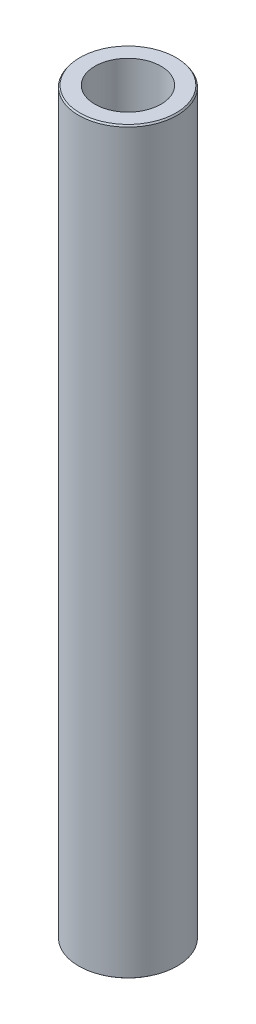
ISO-10303-21;
HEADER;
FILE_DESCRIPTION(('STEP AP214'),'2;1');
FILE_NAME('part.step','',(''),(''),'','','');
FILE_SCHEMA(('AUTOMOTIVE_DESIGN { 1 0 10303 214 1 1 1 1 }'));
ENDSEC;
DATA;
#1=APPLICATION_CONTEXT('core data for automotive mechanical design processes');
#2=APPLICATION_PROTOCOL_DEFINITION('international standard','automotive_design',2000,#1);
#3=PRODUCT_CONTEXT('',#1,'mechanical');
#4=PRODUCT('Part','Part','',(#3));
#5=PRODUCT_RELATED_PRODUCT_CATEGORY('part','',(#4));
#6=PRODUCT_DEFINITION_FORMATION('','',#4);
#7=PRODUCT_DEFINITION_CONTEXT('part definition',#1,'design');
#8=PRODUCT_DEFINITION('design','',#6,#7);
#9=PRODUCT_DEFINITION_SHAPE('','',#8);
#10=(LENGTH_UNIT() NAMED_UNIT(*) SI_UNIT(.MILLI.,.METRE.));
#11=(NAMED_UNIT(*) PLANE_ANGLE_UNIT() SI_UNIT($,.RADIAN.));
#12=(NAMED_UNIT(*) SI_UNIT($,.STERADIAN.) SOLID_ANGLE_UNIT());
#13=UNCERTAINTY_MEASURE_WITH_UNIT(LENGTH_MEASURE(1.E-05),#10,'distance_accuracy_value','');
#14=(GEOMETRIC_REPRESENTATION_CONTEXT(3) GLOBAL_UNCERTAINTY_ASSIGNED_CONTEXT((#13)) GLOBAL_UNIT_ASSIGNED_CONTEXT((#10,
#11,#12)) REPRESENTATION_CONTEXT('',''));
#15=CARTESIAN_POINT('',(0.,0.,0.));
#16=DIRECTION('',(0.,0.,1.));
#17=DIRECTION('',(1.,0.,0.));
#18=AXIS2_PLACEMENT_3D('',#15,#16,#17);
#19=CARTESIAN_POINT('',(0.,225.434529884154,0.));
#20=DIRECTION('',(0.,-1.,0.));
#21=DIRECTION('',(0.,0.,-1.));
#22=AXIS2_PLACEMENT_3D('',#19,#20,#21);
#23=CYLINDRICAL_SURFACE('',#22,15.);
#24=CARTESIAN_POINT('',(0.,224.967875734691,0.));
#25=DIRECTION('',(0.,1.,0.));
#26=DIRECTION('',(0.,0.,1.));
#27=AXIS2_PLACEMENT_3D('',#24,#25,#26);
#28=CIRCLE('',#27,15.);
#29=CARTESIAN_POINT('',(0.,224.967875734691,15.));
#30=VERTEX_POINT('',#29);
#31=EDGE_CURVE('E50',#30,#30,#28,.F.);
#32=ORIENTED_EDGE('',*,*,#31,.T.);
#33=EDGE_LOOP('',(#32));
#34=FACE_BOUND('',#33,.T.);
#35=CARTESIAN_POINT('',(0.,0.355404783325464,0.));
#36=DIRECTION('',(0.,1.,0.));
#37=DIRECTION('',(0.,0.,1.));
#38=AXIS2_PLACEMENT_3D('',#35,#36,#37);
#39=CIRCLE('',#38,15.);
#40=CARTESIAN_POINT('',(0.,0.355404783325464,15.));
#41=VERTEX_POINT('',#40);
#42=EDGE_CURVE('E51',#41,#41,#39,.T.);
#43=ORIENTED_EDGE('',*,*,#42,.T.);
#44=EDGE_LOOP('',(#43));
#45=FACE_BOUND('',#44,.T.);
#46=ADVANCED_FACE('F39',(#34,#45),#23,.T.);
#47=CARTESIAN_POINT('',(0.,225.434529884154,0.));
#48=DIRECTION('',(0.,1.,0.));
#49=DIRECTION('',(0.,0.,1.));
#50=AXIS2_PLACEMENT_3D('',#47,#48,#49);
#51=PLANE('',#50);
#52=CARTESIAN_POINT('',(0.,225.434529884154,0.));
#53=DIRECTION('',(0.,1.,0.));
#54=DIRECTION('',(0.,0.,1.));
#55=AXIS2_PLACEMENT_3D('',#52,#53,#54);
#56=CIRCLE('',#55,14.6445952166746);
#57=CARTESIAN_POINT('',(0.,225.434529884154,14.6445952166746));
#58=VERTEX_POINT('',#57);
#59=EDGE_CURVE('E54',#58,#58,#56,.T.);
#60=ORIENTED_EDGE('',*,*,#59,.T.);
#61=EDGE_LOOP('',(#60));
#62=FACE_BOUND('',#61,.T.);
#63=CARTESIAN_POINT('',(0.,225.434529884154,0.));
#64=DIRECTION('',(0.,1.,0.));
#65=DIRECTION('',(0.,0.,1.));
#66=AXIS2_PLACEMENT_3D('',#63,#64,#65);
#67=CIRCLE('',#66,10.0658850648264);
#68=CARTESIAN_POINT('',(0.,225.434529884154,10.0658850648264));
#69=VERTEX_POINT('',#68);
#70=EDGE_CURVE('E58',#69,#69,#67,.T.);
#71=ORIENTED_EDGE('',*,*,#70,.F.);
#72=EDGE_LOOP('',(#71));
#73=FACE_BOUND('',#72,.T.);
#74=ADVANCED_FACE('F69',(#62,#73),#51,.T.);
#75=CARTESIAN_POINT('',(0.,0.,0.));
#76=DIRECTION('',(0.,1.,0.));
#77=DIRECTION('',(0.,0.,1.));
#78=AXIS2_PLACEMENT_3D('',#75,#76,#77);
#79=PLANE('',#78);
#80=CARTESIAN_POINT('',(0.,0.,0.));
#81=DIRECTION('',(0.,1.,0.));
#82=DIRECTION('',(0.,0.,1.));
#83=AXIS2_PLACEMENT_3D('',#80,#81,#82);
#84=CIRCLE('',#83,14.5333458505369);
#85=CARTESIAN_POINT('',(0.,0.,14.5333458505369));
#86=VERTEX_POINT('',#85);
#87=EDGE_CURVE('E10',#86,#86,#84,.F.);
#88=ORIENTED_EDGE('',*,*,#87,.T.);
#89=EDGE_LOOP('',(#88));
#90=FACE_BOUND('',#89,.T.);
#91=CARTESIAN_POINT('',(0.,0.,0.));
#92=DIRECTION('',(0.,1.,0.));
#93=DIRECTION('',(0.,0.,1.));
#94=AXIS2_PLACEMENT_3D('',#91,#92,#93);
#95=CIRCLE('',#94,10.0658850648264);
#96=CARTESIAN_POINT('',(0.,0.,10.0658850648264));
#97=VERTEX_POINT('',#96);
#98=EDGE_CURVE('E63',#97,#97,#95,.T.);
#99=ORIENTED_EDGE('',*,*,#98,.T.);
#100=EDGE_LOOP('',(#99));
#101=FACE_BOUND('',#100,.T.);
#102=ADVANCED_FACE('F75',(#90,#101),#79,.F.);
#103=CARTESIAN_POINT('',(0.,225.434529884154,0.));
#104=DIRECTION('',(0.,-1.,0.));
#105=DIRECTION('',(0.,0.,-1.));
#106=AXIS2_PLACEMENT_3D('',#103,#104,#105);
#107=CYLINDRICAL_SURFACE('',#106,10.0658850648264);
#108=ORIENTED_EDGE('',*,*,#70,.T.);
#109=EDGE_LOOP('',(#108));
#110=FACE_BOUND('',#109,.T.);
#111=ORIENTED_EDGE('',*,*,#98,.F.);
#112=EDGE_LOOP('',(#111));
#113=FACE_BOUND('',#112,.T.);
#114=ADVANCED_FACE('F70',(#110,#113),#107,.F.);
#115=CARTESIAN_POINT('',(0.,225.434529884154,0.));
#116=DIRECTION('',(0.,-1.,0.));
#117=DIRECTION('',(0.,0.,-1.));
#118=AXIS2_PLACEMENT_3D('',#115,#116,#117);
#119=CONICAL_SURFACE('',#118,14.6445952166746,0.650885200030597);
#120=ORIENTED_EDGE('',*,*,#31,.F.);
#121=EDGE_LOOP('',(#120));
#122=FACE_BOUND('',#121,.T.);
#123=ORIENTED_EDGE('',*,*,#59,.F.);
#124=EDGE_LOOP('',(#123));
#125=FACE_BOUND('',#124,.T.);
#126=ADVANCED_FACE('F81',(#122,#125),#119,.T.);
#127=CARTESIAN_POINT('',(0.,0.355404783325464,0.));
#128=DIRECTION('',(0.,1.,0.));
#129=DIRECTION('',(0.,0.,1.));
#130=AXIS2_PLACEMENT_3D('',#127,#128,#129);
#131=CONICAL_SURFACE('',#130,15.,0.919911126764278);
#132=ORIENTED_EDGE('',*,*,#87,.F.);
#133=EDGE_LOOP('',(#132));
#134=FACE_BOUND('',#133,.T.);
#135=ORIENTED_EDGE('',*,*,#42,.F.);
#136=EDGE_LOOP('',(#135));
#137=FACE_BOUND('',#136,.T.);
#138=ADVANCED_FACE('F45',(#134,#137),#131,.T.);
#139=CLOSED_SHELL('',(#46,#74,#102,#114,#126,#138));
#140=MANIFOLD_SOLID_BREP('B2',#139);
#141=ADVANCED_BREP_SHAPE_REPRESENTATION('',(#18,#140),#14);
#142=SHAPE_DEFINITION_REPRESENTATION(#9,#141);
ENDSEC;
END-ISO-10303-21;
